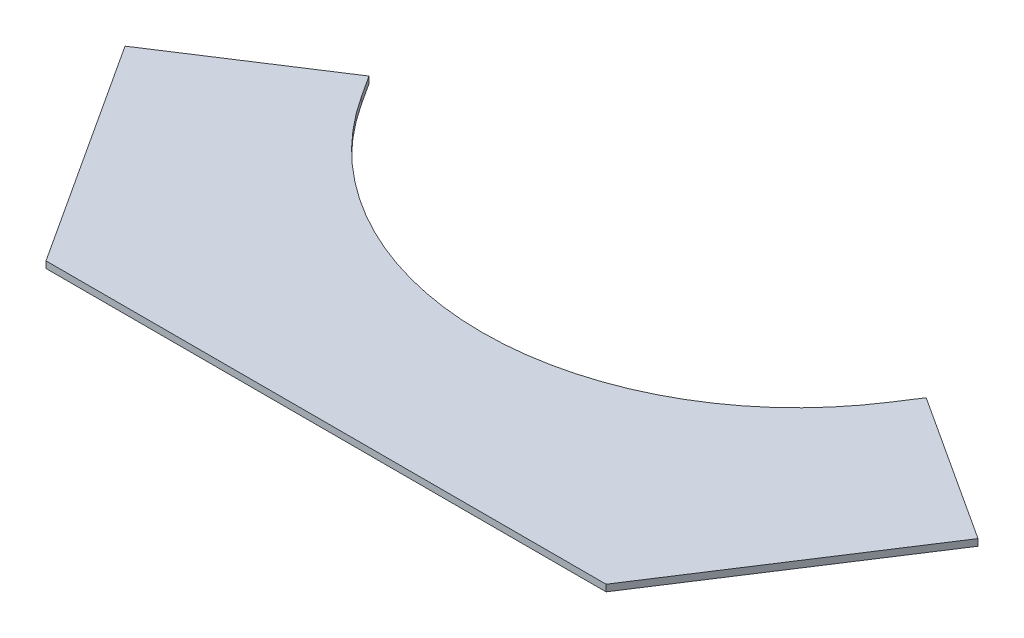
ISO-10303-21;
HEADER;
FILE_DESCRIPTION(('STEP AP214'),'2;1');
FILE_NAME('part.step','',(''),(''),'','','');
FILE_SCHEMA(('AUTOMOTIVE_DESIGN { 1 0 10303 214 1 1 1 1 }'));
ENDSEC;
DATA;
#1=APPLICATION_CONTEXT('core data for automotive mechanical design processes');
#2=APPLICATION_PROTOCOL_DEFINITION('international standard','automotive_design',2000,#1);
#3=PRODUCT_CONTEXT('',#1,'mechanical');
#4=PRODUCT('Part','Part','',(#3));
#5=PRODUCT_RELATED_PRODUCT_CATEGORY('part','',(#4));
#6=PRODUCT_DEFINITION_FORMATION('','',#4);
#7=PRODUCT_DEFINITION_CONTEXT('part definition',#1,'design');
#8=PRODUCT_DEFINITION('design','',#6,#7);
#9=PRODUCT_DEFINITION_SHAPE('','',#8);
#10=(LENGTH_UNIT() NAMED_UNIT(*) SI_UNIT(.MILLI.,.METRE.));
#11=(NAMED_UNIT(*) PLANE_ANGLE_UNIT() SI_UNIT($,.RADIAN.));
#12=(NAMED_UNIT(*) SI_UNIT($,.STERADIAN.) SOLID_ANGLE_UNIT());
#13=UNCERTAINTY_MEASURE_WITH_UNIT(LENGTH_MEASURE(1.E-05),#10,'distance_accuracy_value','');
#14=(GEOMETRIC_REPRESENTATION_CONTEXT(3) GLOBAL_UNCERTAINTY_ASSIGNED_CONTEXT((#13)) GLOBAL_UNIT_ASSIGNED_CONTEXT((#10,
#11,#12)) REPRESENTATION_CONTEXT('',''));
#15=CARTESIAN_POINT('',(0.,0.,0.));
#16=DIRECTION('',(0.,0.,1.));
#17=DIRECTION('',(1.,0.,0.));
#18=AXIS2_PLACEMENT_3D('',#15,#16,#17);
#19=CARTESIAN_POINT('',(-139.851376596993,6.35,-215.352234962946));
#20=DIRECTION('',(0.838670567945421,0.,-0.544639035015032));
#21=DIRECTION('',(-0.544639035015032,0.,-0.838670567945421));
#22=AXIS2_PLACEMENT_3D('',#19,#20,#21);
#23=PLANE('',#22);
#24=DIRECTION('',(0.544639035015032,0.,0.838670567945421));
#25=VECTOR('',#24,1.);
#26=CARTESIAN_POINT('',(-139.851376596993,0.,-215.352234962946));
#27=LINE('',#26,#25);
#28=CARTESIAN_POINT('',(-139.851376596993,0.,-215.352234962946));
#29=VERTEX_POINT('',#28);
#30=CARTESIAN_POINT('',(0.,0.,0.));
#31=VERTEX_POINT('',#30);
#32=EDGE_CURVE('E129',#29,#31,#27,.T.);
#33=ORIENTED_EDGE('',*,*,#32,.T.);
#34=DIRECTION('',(0.,-1.,0.));
#35=VECTOR('',#34,1.);
#36=CARTESIAN_POINT('',(0.,6.35,0.));
#37=LINE('',#36,#35);
#38=CARTESIAN_POINT('',(0.,6.35,0.));
#39=VERTEX_POINT('',#38);
#40=EDGE_CURVE('E11',#39,#31,#37,.T.);
#41=ORIENTED_EDGE('',*,*,#40,.F.);
#42=DIRECTION('',(0.544639035015032,0.,0.838670567945421));
#43=VECTOR('',#42,1.);
#44=CARTESIAN_POINT('',(-139.851376596993,6.35,-215.352234962946));
#45=LINE('',#44,#43);
#46=CARTESIAN_POINT('',(-139.851376596993,6.35,-215.352234962946));
#47=VERTEX_POINT('',#46);
#48=EDGE_CURVE('E143',#47,#39,#45,.T.);
#49=ORIENTED_EDGE('',*,*,#48,.F.);
#50=DIRECTION('',(0.,-1.,0.));
#51=VECTOR('',#50,1.);
#52=CARTESIAN_POINT('',(-139.851376596993,6.35,-215.352234962946));
#53=LINE('',#52,#51);
#54=EDGE_CURVE('E125',#47,#29,#53,.T.);
#55=ORIENTED_EDGE('',*,*,#54,.T.);
#56=EDGE_LOOP('',(#33,#41,#49,#55));
#57=FACE_BOUND('',#56,.T.);
#58=ADVANCED_FACE('F33',(#57),#23,.F.);
#59=CARTESIAN_POINT('',(0.,6.35,0.));
#60=DIRECTION('',(0.,0.,-1.));
#61=DIRECTION('',(-1.,0.,0.));
#62=AXIS2_PLACEMENT_3D('',#59,#60,#61);
#63=PLANE('',#62);
#64=DIRECTION('',(1.,0.,0.));
#65=VECTOR('',#64,1.);
#66=CARTESIAN_POINT('',(0.,0.,0.));
#67=LINE('',#66,#65);
#68=CARTESIAN_POINT('',(534.9068,0.,0.));
#69=VERTEX_POINT('',#68);
#70=EDGE_CURVE('E132',#31,#69,#67,.T.);
#71=ORIENTED_EDGE('',*,*,#70,.T.);
#72=DIRECTION('',(0.,-1.,0.));
#73=VECTOR('',#72,1.);
#74=CARTESIAN_POINT('',(534.9068,6.35,0.));
#75=LINE('',#74,#73);
#76=CARTESIAN_POINT('',(534.9068,6.35,0.));
#77=VERTEX_POINT('',#76);
#78=EDGE_CURVE('E41',#77,#69,#75,.T.);
#79=ORIENTED_EDGE('',*,*,#78,.F.);
#80=DIRECTION('',(1.,0.,0.));
#81=VECTOR('',#80,1.);
#82=CARTESIAN_POINT('',(0.,6.35,0.));
#83=LINE('',#82,#81);
#84=EDGE_CURVE('E92',#39,#77,#83,.T.);
#85=ORIENTED_EDGE('',*,*,#84,.F.);
#86=ORIENTED_EDGE('',*,*,#40,.T.);
#87=EDGE_LOOP('',(#71,#79,#85,#86));
#88=FACE_BOUND('',#87,.T.);
#89=ADVANCED_FACE('F178',(#88),#63,.F.);
#90=CARTESIAN_POINT('',(674.758176596991,6.35,-215.352234962947));
#91=DIRECTION('',(-0.838670567945426,0.,-0.544639035015024));
#92=DIRECTION('',(-0.544639035015024,0.,0.838670567945426));
#93=AXIS2_PLACEMENT_3D('',#90,#91,#92);
#94=PLANE('',#93);
#95=DIRECTION('',(0.544639035015024,0.,-0.838670567945426));
#96=VECTOR('',#95,1.);
#97=CARTESIAN_POINT('',(674.758176596991,0.,-215.352234962947));
#98=LINE('',#97,#96);
#99=CARTESIAN_POINT('',(674.758176596991,0.,-215.352234962947));
#100=VERTEX_POINT('',#99);
#101=EDGE_CURVE('E134',#69,#100,#98,.T.);
#102=ORIENTED_EDGE('',*,*,#101,.T.);
#103=DIRECTION('',(0.,-1.,0.));
#104=VECTOR('',#103,1.);
#105=CARTESIAN_POINT('',(674.758176596991,6.35,-215.352234962947));
#106=LINE('',#105,#104);
#107=CARTESIAN_POINT('',(674.758176596991,6.35,-215.352234962947));
#108=VERTEX_POINT('',#107);
#109=EDGE_CURVE('E150',#108,#100,#106,.T.);
#110=ORIENTED_EDGE('',*,*,#109,.F.);
#111=DIRECTION('',(0.544639035015024,0.,-0.838670567945426));
#112=VECTOR('',#111,1.);
#113=CARTESIAN_POINT('',(674.758176596991,6.35,-215.352234962947));
#114=LINE('',#113,#112);
#115=EDGE_CURVE('E158',#77,#108,#114,.T.);
#116=ORIENTED_EDGE('',*,*,#115,.F.);
#117=ORIENTED_EDGE('',*,*,#78,.T.);
#118=EDGE_LOOP('',(#102,#110,#116,#117));
#119=FACE_BOUND('',#118,.T.);
#120=ADVANCED_FACE('F156',(#119),#94,.F.);
#121=CARTESIAN_POINT('',(674.758176596991,6.35,-215.352234962947));
#122=DIRECTION('',(-0.54463903501503,0.,0.838670567945422));
#123=DIRECTION('',(0.838670567945422,0.,0.54463903501503));
#124=AXIS2_PLACEMENT_3D('',#121,#122,#123);
#125=PLANE('',#124);
#126=DIRECTION('',(-0.838670567945422,0.,-0.54463903501503));
#127=VECTOR('',#126,1.);
#128=CARTESIAN_POINT('',(674.758176596991,0.,-215.352234962947));
#129=LINE('',#128,#127);
#130=CARTESIAN_POINT('',(533.506092595465,0.,-307.082410868512));
#131=VERTEX_POINT('',#130);
#132=EDGE_CURVE('E136',#100,#131,#129,.T.);
#133=ORIENTED_EDGE('',*,*,#132,.T.);
#134=DIRECTION('',(0.,-1.,0.));
#135=VECTOR('',#134,1.);
#136=CARTESIAN_POINT('',(533.506092595465,6.35,-307.082410868512));
#137=LINE('',#136,#135);
#138=CARTESIAN_POINT('',(533.506092595465,6.35,-307.082410868512));
#139=VERTEX_POINT('',#138);
#140=EDGE_CURVE('E147',#139,#131,#137,.T.);
#141=ORIENTED_EDGE('',*,*,#140,.F.);
#142=DIRECTION('',(-0.838670567945422,0.,-0.54463903501503));
#143=VECTOR('',#142,1.);
#144=CARTESIAN_POINT('',(674.758176596991,6.35,-215.352234962947));
#145=LINE('',#144,#143);
#146=EDGE_CURVE('E170',#108,#139,#145,.T.);
#147=ORIENTED_EDGE('',*,*,#146,.F.);
#148=ORIENTED_EDGE('',*,*,#109,.T.);
#149=EDGE_LOOP('',(#133,#141,#147,#148));
#150=FACE_BOUND('',#149,.T.);
#151=ADVANCED_FACE('F166',(#150),#125,.F.);
#152=CARTESIAN_POINT('',(533.506092595465,6.35,-307.082410868512));
#153=DIRECTION('',(0.838670567945427,0.,0.544639035015022));
#154=DIRECTION('',(0.544639035015022,0.,-0.838670567945427));
#155=AXIS2_PLACEMENT_3D('',#152,#153,#154);
#156=PLANE('',#155);
#157=DIRECTION('',(-0.544639035015022,0.,0.838670567945427));
#158=VECTOR('',#157,1.);
#159=CARTESIAN_POINT('',(533.506092595465,0.,-307.082410868512));
#160=LINE('',#159,#158);
#161=CARTESIAN_POINT('',(519.890116720089,0.,-286.115646669875));
#162=VERTEX_POINT('',#161);
#163=EDGE_CURVE('E138',#131,#162,#160,.T.);
#164=ORIENTED_EDGE('',*,*,#163,.T.);
#165=DIRECTION('',(0.,-1.,0.));
#166=VECTOR('',#165,1.);
#167=CARTESIAN_POINT('',(519.890116720089,6.35,-286.115646669875));
#168=LINE('',#167,#166);
#169=CARTESIAN_POINT('',(519.890116720089,6.35,-286.115646669875));
#170=VERTEX_POINT('',#169);
#171=EDGE_CURVE('E120',#170,#162,#168,.T.);
#172=ORIENTED_EDGE('',*,*,#171,.F.);
#173=DIRECTION('',(-0.544639035015022,0.,0.838670567945427));
#174=VECTOR('',#173,1.);
#175=CARTESIAN_POINT('',(533.506092595465,6.35,-307.082410868512));
#176=LINE('',#175,#174);
#177=EDGE_CURVE('E111',#139,#170,#176,.T.);
#178=ORIENTED_EDGE('',*,*,#177,.F.);
#179=ORIENTED_EDGE('',*,*,#140,.T.);
#180=EDGE_LOOP('',(#164,#172,#178,#179));
#181=FACE_BOUND('',#180,.T.);
#182=ADVANCED_FACE('F169',(#181),#156,.F.);
#183=CARTESIAN_POINT('',(267.453399999999,6.35,-450.049967309753));
#184=DIRECTION('',(0.,-1.,0.));
#185=DIRECTION('',(0.,0.,-1.));
#186=AXIS2_PLACEMENT_3D('',#183,#184,#185);
#187=CYLINDRICAL_SURFACE('',#186,300.996274781063);
#188=CARTESIAN_POINT('',(267.453399999999,0.,-450.049967309753));
#189=DIRECTION('',(0.,-1.,0.));
#190=DIRECTION('',(0.,0.,1.));
#191=AXIS2_PLACEMENT_3D('',#188,#189,#190);
#192=CIRCLE('',#191,300.996274781063);
#193=CARTESIAN_POINT('',(15.0166832799085,0.,-286.115646669875));
#194=VERTEX_POINT('',#193);
#195=EDGE_CURVE('E119',#162,#194,#192,.T.);
#196=ORIENTED_EDGE('',*,*,#195,.T.);
#197=DIRECTION('',(0.,-1.,0.));
#198=VECTOR('',#197,1.);
#199=CARTESIAN_POINT('',(15.0166832799085,6.35,-286.115646669875));
#200=LINE('',#199,#198);
#201=CARTESIAN_POINT('',(15.0166832799085,6.35,-286.115646669875));
#202=VERTEX_POINT('',#201);
#203=EDGE_CURVE('E116',#202,#194,#200,.T.);
#204=ORIENTED_EDGE('',*,*,#203,.F.);
#205=CARTESIAN_POINT('',(267.453399999999,6.35,-450.049967309753));
#206=DIRECTION('',(0.,-1.,0.));
#207=DIRECTION('',(0.,0.,1.));
#208=AXIS2_PLACEMENT_3D('',#205,#206,#207);
#209=CIRCLE('',#208,300.996274781063);
#210=EDGE_CURVE('E105',#170,#202,#209,.T.);
#211=ORIENTED_EDGE('',*,*,#210,.F.);
#212=ORIENTED_EDGE('',*,*,#171,.T.);
#213=EDGE_LOOP('',(#196,#204,#211,#212));
#214=FACE_BOUND('',#213,.T.);
#215=ADVANCED_FACE('F117',(#214),#187,.F.);
#216=CARTESIAN_POINT('',(1.40070740453271,6.35,-307.082410868511));
#217=DIRECTION('',(-0.83867056794542,0.,0.544639035015033));
#218=DIRECTION('',(0.544639035015033,0.,0.83867056794542));
#219=AXIS2_PLACEMENT_3D('',#216,#217,#218);
#220=PLANE('',#219);
#221=DIRECTION('',(-0.544639035015033,0.,-0.83867056794542));
#222=VECTOR('',#221,1.);
#223=CARTESIAN_POINT('',(1.40070740453271,0.,-307.082410868511));
#224=LINE('',#223,#222);
#225=CARTESIAN_POINT('',(1.40070740453271,0.,-307.082410868511));
#226=VERTEX_POINT('',#225);
#227=EDGE_CURVE('E78',#194,#226,#224,.T.);
#228=ORIENTED_EDGE('',*,*,#227,.T.);
#229=DIRECTION('',(0.,-1.,0.));
#230=VECTOR('',#229,1.);
#231=CARTESIAN_POINT('',(1.40070740453271,6.35,-307.082410868511));
#232=LINE('',#231,#230);
#233=CARTESIAN_POINT('',(1.40070740453271,6.35,-307.082410868511));
#234=VERTEX_POINT('',#233);
#235=EDGE_CURVE('E121',#234,#226,#232,.T.);
#236=ORIENTED_EDGE('',*,*,#235,.F.);
#237=DIRECTION('',(-0.544639035015033,0.,-0.83867056794542));
#238=VECTOR('',#237,1.);
#239=CARTESIAN_POINT('',(1.40070740453271,6.35,-307.082410868511));
#240=LINE('',#239,#238);
#241=EDGE_CURVE('E109',#202,#234,#240,.T.);
#242=ORIENTED_EDGE('',*,*,#241,.F.);
#243=ORIENTED_EDGE('',*,*,#203,.T.);
#244=EDGE_LOOP('',(#228,#236,#242,#243));
#245=FACE_BOUND('',#244,.T.);
#246=ADVANCED_FACE('F123',(#245),#220,.F.);
#247=CARTESIAN_POINT('',(-139.851376596993,6.35,-215.352234962946));
#248=DIRECTION('',(0.544639035015032,0.,0.838670567945421));
#249=DIRECTION('',(0.838670567945421,0.,-0.544639035015032));
#250=AXIS2_PLACEMENT_3D('',#247,#248,#249);
#251=PLANE('',#250);
#252=DIRECTION('',(-0.838670567945421,0.,0.544639035015032));
#253=VECTOR('',#252,1.);
#254=CARTESIAN_POINT('',(-139.851376596993,0.,-215.352234962946));
#255=LINE('',#254,#253);
#256=EDGE_CURVE('E84',#226,#29,#255,.T.);
#257=ORIENTED_EDGE('',*,*,#256,.T.);
#258=ORIENTED_EDGE('',*,*,#54,.F.);
#259=DIRECTION('',(-0.838670567945421,0.,0.544639035015032));
#260=VECTOR('',#259,1.);
#261=CARTESIAN_POINT('',(-139.851376596993,6.35,-215.352234962946));
#262=LINE('',#261,#260);
#263=EDGE_CURVE('E49',#234,#47,#262,.T.);
#264=ORIENTED_EDGE('',*,*,#263,.F.);
#265=ORIENTED_EDGE('',*,*,#235,.T.);
#266=EDGE_LOOP('',(#257,#258,#264,#265));
#267=FACE_BOUND('',#266,.T.);
#268=ADVANCED_FACE('F194',(#267),#251,.F.);
#269=CARTESIAN_POINT('',(267.453399999999,6.35,-450.049967309753));
#270=DIRECTION('',(0.,1.,0.));
#271=DIRECTION('',(0.,0.,1.));
#272=AXIS2_PLACEMENT_3D('',#269,#270,#271);
#273=PLANE('',#272);
#274=ORIENTED_EDGE('',*,*,#48,.T.);
#275=ORIENTED_EDGE('',*,*,#84,.T.);
#276=ORIENTED_EDGE('',*,*,#115,.T.);
#277=ORIENTED_EDGE('',*,*,#146,.T.);
#278=ORIENTED_EDGE('',*,*,#177,.T.);
#279=ORIENTED_EDGE('',*,*,#210,.T.);
#280=ORIENTED_EDGE('',*,*,#241,.T.);
#281=ORIENTED_EDGE('',*,*,#263,.T.);
#282=EDGE_LOOP('',(#274,#275,#276,#277,#278,#279,#280,#281));
#283=FACE_BOUND('',#282,.T.);
#284=ADVANCED_FACE('F107',(#283),#273,.T.);
#285=CARTESIAN_POINT('',(267.453399999999,0.,-450.049967309753));
#286=DIRECTION('',(0.,1.,0.));
#287=DIRECTION('',(0.,0.,1.));
#288=AXIS2_PLACEMENT_3D('',#285,#286,#287);
#289=PLANE('',#288);
#290=ORIENTED_EDGE('',*,*,#32,.F.);
#291=ORIENTED_EDGE('',*,*,#256,.F.);
#292=ORIENTED_EDGE('',*,*,#227,.F.);
#293=ORIENTED_EDGE('',*,*,#195,.F.);
#294=ORIENTED_EDGE('',*,*,#163,.F.);
#295=ORIENTED_EDGE('',*,*,#132,.F.);
#296=ORIENTED_EDGE('',*,*,#101,.F.);
#297=ORIENTED_EDGE('',*,*,#70,.F.);
#298=EDGE_LOOP('',(#290,#291,#292,#293,#294,#295,#296,#297));
#299=FACE_BOUND('',#298,.T.);
#300=ADVANCED_FACE('F162',(#299),#289,.F.);
#301=CLOSED_SHELL('',(#58,#89,#120,#151,#182,#215,#246,#268,#284,#300));
#302=MANIFOLD_SOLID_BREP('B2',#301);
#303=ADVANCED_BREP_SHAPE_REPRESENTATION('',(#18,#302),#14);
#304=SHAPE_DEFINITION_REPRESENTATION(#9,#303);
ENDSEC;
END-ISO-10303-21;
